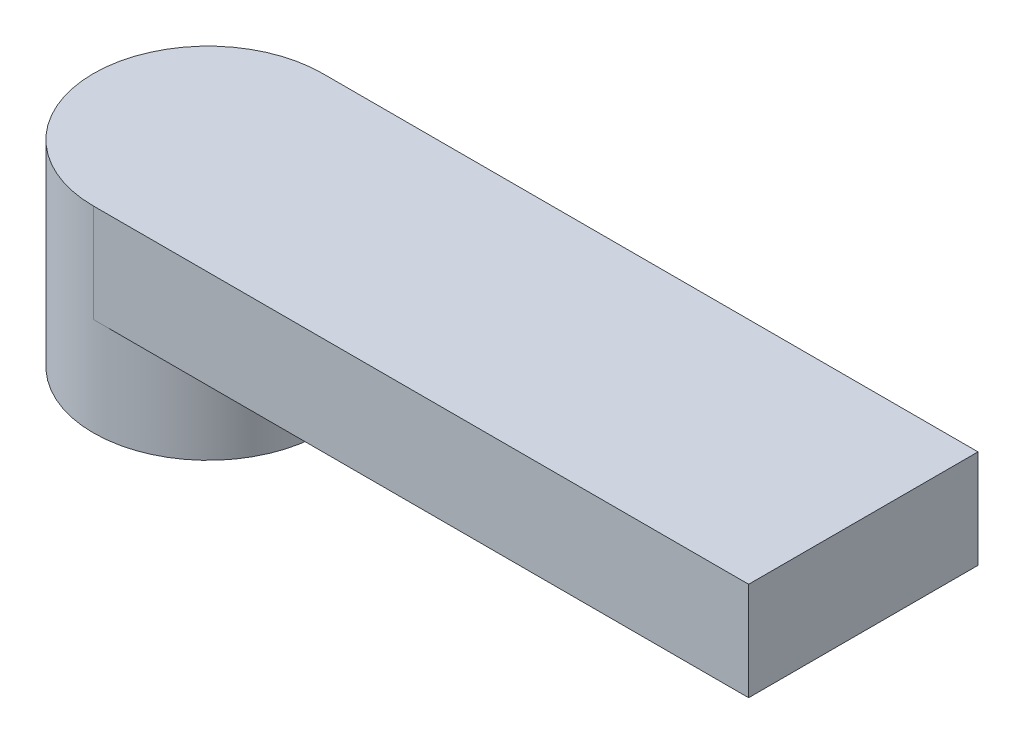
ISO-10303-21;
HEADER;
FILE_DESCRIPTION(('STEP AP214'),'2;1');
FILE_NAME('part.step','',(''),(''),'','','');
FILE_SCHEMA(('AUTOMOTIVE_DESIGN { 1 0 10303 214 1 1 1 1 }'));
ENDSEC;
DATA;
#1=APPLICATION_CONTEXT('core data for automotive mechanical design processes');
#2=APPLICATION_PROTOCOL_DEFINITION('international standard','automotive_design',2000,#1);
#3=PRODUCT_CONTEXT('',#1,'mechanical');
#4=PRODUCT('Part','Part','',(#3));
#5=PRODUCT_RELATED_PRODUCT_CATEGORY('part','',(#4));
#6=PRODUCT_DEFINITION_FORMATION('','',#4);
#7=PRODUCT_DEFINITION_CONTEXT('part definition',#1,'design');
#8=PRODUCT_DEFINITION('design','',#6,#7);
#9=PRODUCT_DEFINITION_SHAPE('','',#8);
#10=(LENGTH_UNIT() NAMED_UNIT(*) SI_UNIT(.MILLI.,.METRE.));
#11=(NAMED_UNIT(*) PLANE_ANGLE_UNIT() SI_UNIT($,.RADIAN.));
#12=(NAMED_UNIT(*) SI_UNIT($,.STERADIAN.) SOLID_ANGLE_UNIT());
#13=UNCERTAINTY_MEASURE_WITH_UNIT(LENGTH_MEASURE(1.E-05),#10,'distance_accuracy_value','');
#14=(GEOMETRIC_REPRESENTATION_CONTEXT(3) GLOBAL_UNCERTAINTY_ASSIGNED_CONTEXT((#13)) GLOBAL_UNIT_ASSIGNED_CONTEXT((#10,
#11,#12)) REPRESENTATION_CONTEXT('',''));
#15=CARTESIAN_POINT('',(0.,0.,0.));
#16=DIRECTION('',(0.,0.,1.));
#17=DIRECTION('',(1.,0.,0.));
#18=AXIS2_PLACEMENT_3D('',#15,#16,#17);
#19=CARTESIAN_POINT('',(0.,6.,0.));
#20=DIRECTION('',(0.,-1.,0.));
#21=DIRECTION('',(0.,0.,-1.));
#22=AXIS2_PLACEMENT_3D('',#19,#20,#21);
#23=CYLINDRICAL_SURFACE('',#22,3.5);
#24=CARTESIAN_POINT('',(0.,6.,0.));
#25=DIRECTION('',(0.,1.,0.));
#26=DIRECTION('',(0.,0.,1.));
#27=AXIS2_PLACEMENT_3D('',#24,#25,#26);
#28=CIRCLE('',#27,3.5);
#29=CARTESIAN_POINT('',(0.,6.,-3.5));
#30=VERTEX_POINT('',#29);
#31=CARTESIAN_POINT('',(0.,6.,3.5));
#32=VERTEX_POINT('',#31);
#33=EDGE_CURVE('E11',#30,#32,#28,.T.);
#34=ORIENTED_EDGE('',*,*,#33,.F.);
#35=DIRECTION('',(0.,1.,0.));
#36=VECTOR('',#35,1.);
#37=CARTESIAN_POINT('',(0.,3.,-3.5));
#38=LINE('',#37,#36);
#39=CARTESIAN_POINT('',(0.,3.,-3.5));
#40=VERTEX_POINT('',#39);
#41=EDGE_CURVE('E116',#40,#30,#38,.T.);
#42=ORIENTED_EDGE('',*,*,#41,.F.);
#43=CARTESIAN_POINT('',(0.,3.,0.));
#44=DIRECTION('',(0.,-1.,0.));
#45=DIRECTION('',(0.,0.,1.));
#46=AXIS2_PLACEMENT_3D('',#43,#44,#45);
#47=CIRCLE('',#46,3.5);
#48=CARTESIAN_POINT('',(0.,3.,3.5));
#49=VERTEX_POINT('',#48);
#50=EDGE_CURVE('E62',#40,#49,#47,.T.);
#51=ORIENTED_EDGE('',*,*,#50,.T.);
#52=DIRECTION('',(0.,1.,0.));
#53=VECTOR('',#52,1.);
#54=CARTESIAN_POINT('',(0.,3.,3.5));
#55=LINE('',#54,#53);
#56=EDGE_CURVE('E86',#49,#32,#55,.T.);
#57=ORIENTED_EDGE('',*,*,#56,.T.);
#58=EDGE_LOOP('',(#34,#42,#51,#57));
#59=FACE_BOUND('',#58,.T.);
#60=CARTESIAN_POINT('',(0.,0.,0.));
#61=DIRECTION('',(0.,1.,0.));
#62=DIRECTION('',(0.,0.,1.));
#63=AXIS2_PLACEMENT_3D('',#60,#61,#62);
#64=CIRCLE('',#63,3.5);
#65=CARTESIAN_POINT('',(0.,0.,3.5));
#66=VERTEX_POINT('',#65);
#67=EDGE_CURVE('E42',#66,#66,#64,.T.);
#68=ORIENTED_EDGE('',*,*,#67,.T.);
#69=EDGE_LOOP('',(#68));
#70=FACE_BOUND('',#69,.T.);
#71=ADVANCED_FACE('F39',(#59,#70),#23,.T.);
#72=CARTESIAN_POINT('',(0.,6.,0.));
#73=DIRECTION('',(0.,1.,0.));
#74=DIRECTION('',(0.,0.,1.));
#75=AXIS2_PLACEMENT_3D('',#72,#73,#74);
#76=PLANE('',#75);
#77=ORIENTED_EDGE('',*,*,#33,.T.);
#78=DIRECTION('',(1.,0.,0.));
#79=VECTOR('',#78,1.);
#80=CARTESIAN_POINT('',(20.,6.,3.5));
#81=LINE('',#80,#79);
#82=CARTESIAN_POINT('',(20.,6.,3.5));
#83=VERTEX_POINT('',#82);
#84=EDGE_CURVE('E109',#32,#83,#81,.T.);
#85=ORIENTED_EDGE('',*,*,#84,.T.);
#86=DIRECTION('',(0.,0.,-1.));
#87=VECTOR('',#86,1.);
#88=CARTESIAN_POINT('',(20.,6.,-3.5));
#89=LINE('',#88,#87);
#90=CARTESIAN_POINT('',(20.,6.,-3.5));
#91=VERTEX_POINT('',#90);
#92=EDGE_CURVE('E92',#83,#91,#89,.T.);
#93=ORIENTED_EDGE('',*,*,#92,.T.);
#94=DIRECTION('',(-1.,0.,0.));
#95=VECTOR('',#94,1.);
#96=CARTESIAN_POINT('',(0.,6.,-3.5));
#97=LINE('',#96,#95);
#98=EDGE_CURVE('E53',#91,#30,#97,.T.);
#99=ORIENTED_EDGE('',*,*,#98,.T.);
#100=EDGE_LOOP('',(#77,#85,#93,#99));
#101=FACE_BOUND('',#100,.T.);
#102=ADVANCED_FACE('F137',(#101),#76,.T.);
#103=CARTESIAN_POINT('',(0.,0.,0.));
#104=DIRECTION('',(0.,1.,0.));
#105=DIRECTION('',(0.,0.,1.));
#106=AXIS2_PLACEMENT_3D('',#103,#104,#105);
#107=PLANE('',#106);
#108=CARTESIAN_POINT('',(0.,0.,0.));
#109=DIRECTION('',(0.,-1.,0.));
#110=DIRECTION('',(0.,0.,-1.));
#111=AXIS2_PLACEMENT_3D('',#108,#109,#110);
#112=CIRCLE('',#111,2.475);
#113=CARTESIAN_POINT('',(0.,0.,-2.475));
#114=VERTEX_POINT('',#113);
#115=EDGE_CURVE('E119',#114,#114,#112,.T.);
#116=ORIENTED_EDGE('',*,*,#115,.F.);
#117=EDGE_LOOP('',(#116));
#118=FACE_BOUND('',#117,.T.);
#119=ORIENTED_EDGE('',*,*,#67,.F.);
#120=EDGE_LOOP('',(#119));
#121=FACE_BOUND('',#120,.T.);
#122=ADVANCED_FACE('F134',(#118,#121),#107,.F.);
#123=CARTESIAN_POINT('',(0.,2.5,0.));
#124=DIRECTION('',(0.,-1.,0.));
#125=DIRECTION('',(0.,0.,-1.));
#126=AXIS2_PLACEMENT_3D('',#123,#124,#125);
#127=CYLINDRICAL_SURFACE('',#126,2.475);
#128=CARTESIAN_POINT('',(0.,2.5,0.));
#129=DIRECTION('',(0.,-1.,0.));
#130=DIRECTION('',(0.,0.,-1.));
#131=AXIS2_PLACEMENT_3D('',#128,#129,#130);
#132=CIRCLE('',#131,2.475);
#133=CARTESIAN_POINT('',(0.,2.5,-2.475));
#134=VERTEX_POINT('',#133);
#135=EDGE_CURVE('E124',#134,#134,#132,.T.);
#136=ORIENTED_EDGE('',*,*,#135,.F.);
#137=EDGE_LOOP('',(#136));
#138=FACE_BOUND('',#137,.T.);
#139=ORIENTED_EDGE('',*,*,#115,.T.);
#140=EDGE_LOOP('',(#139));
#141=FACE_BOUND('',#140,.T.);
#142=ADVANCED_FACE('F132',(#138,#141),#127,.F.);
#143=CARTESIAN_POINT('',(0.,2.5,0.));
#144=DIRECTION('',(0.,-1.,0.));
#145=DIRECTION('',(0.,0.,-1.));
#146=AXIS2_PLACEMENT_3D('',#143,#144,#145);
#147=PLANE('',#146);
#148=ORIENTED_EDGE('',*,*,#135,.T.);
#149=EDGE_LOOP('',(#148));
#150=FACE_BOUND('',#149,.T.);
#151=ADVANCED_FACE('F155',(#150),#147,.T.);
#152=CARTESIAN_POINT('',(0.,3.,-3.5));
#153=DIRECTION('',(0.,0.,-1.));
#154=DIRECTION('',(-1.,0.,0.));
#155=AXIS2_PLACEMENT_3D('',#152,#153,#154);
#156=PLANE('',#155);
#157=ORIENTED_EDGE('',*,*,#98,.F.);
#158=DIRECTION('',(0.,1.,0.));
#159=VECTOR('',#158,1.);
#160=CARTESIAN_POINT('',(20.,3.,-3.5));
#161=LINE('',#160,#159);
#162=CARTESIAN_POINT('',(20.,3.,-3.5));
#163=VERTEX_POINT('',#162);
#164=EDGE_CURVE('E80',#163,#91,#161,.T.);
#165=ORIENTED_EDGE('',*,*,#164,.F.);
#166=DIRECTION('',(-1.,0.,0.));
#167=VECTOR('',#166,1.);
#168=CARTESIAN_POINT('',(0.,3.,-3.5));
#169=LINE('',#168,#167);
#170=EDGE_CURVE('E98',#163,#40,#169,.T.);
#171=ORIENTED_EDGE('',*,*,#170,.T.);
#172=ORIENTED_EDGE('',*,*,#41,.T.);
#173=EDGE_LOOP('',(#157,#165,#171,#172));
#174=FACE_BOUND('',#173,.T.);
#175=ADVANCED_FACE('F153',(#174),#156,.T.);
#176=CARTESIAN_POINT('',(20.,3.,-3.5));
#177=DIRECTION('',(1.,0.,0.));
#178=DIRECTION('',(0.,0.,-1.));
#179=AXIS2_PLACEMENT_3D('',#176,#177,#178);
#180=PLANE('',#179);
#181=ORIENTED_EDGE('',*,*,#92,.F.);
#182=DIRECTION('',(0.,1.,0.));
#183=VECTOR('',#182,1.);
#184=CARTESIAN_POINT('',(20.,3.,3.5));
#185=LINE('',#184,#183);
#186=CARTESIAN_POINT('',(20.,3.,3.5));
#187=VERTEX_POINT('',#186);
#188=EDGE_CURVE('E88',#187,#83,#185,.T.);
#189=ORIENTED_EDGE('',*,*,#188,.F.);
#190=DIRECTION('',(0.,0.,-1.));
#191=VECTOR('',#190,1.);
#192=CARTESIAN_POINT('',(20.,3.,-3.5));
#193=LINE('',#192,#191);
#194=EDGE_CURVE('E91',#187,#163,#193,.T.);
#195=ORIENTED_EDGE('',*,*,#194,.T.);
#196=ORIENTED_EDGE('',*,*,#164,.T.);
#197=EDGE_LOOP('',(#181,#189,#195,#196));
#198=FACE_BOUND('',#197,.T.);
#199=ADVANCED_FACE('F90',(#198),#180,.T.);
#200=CARTESIAN_POINT('',(20.,3.,3.5));
#201=DIRECTION('',(0.,0.,1.));
#202=DIRECTION('',(1.,0.,0.));
#203=AXIS2_PLACEMENT_3D('',#200,#201,#202);
#204=PLANE('',#203);
#205=ORIENTED_EDGE('',*,*,#84,.F.);
#206=ORIENTED_EDGE('',*,*,#56,.F.);
#207=DIRECTION('',(1.,0.,0.));
#208=VECTOR('',#207,1.);
#209=CARTESIAN_POINT('',(20.,3.,3.5));
#210=LINE('',#209,#208);
#211=EDGE_CURVE('E97',#49,#187,#210,.T.);
#212=ORIENTED_EDGE('',*,*,#211,.T.);
#213=ORIENTED_EDGE('',*,*,#188,.T.);
#214=EDGE_LOOP('',(#205,#206,#212,#213));
#215=FACE_BOUND('',#214,.T.);
#216=ADVANCED_FACE('F101',(#215),#204,.T.);
#217=CARTESIAN_POINT('',(0.,3.,0.));
#218=DIRECTION('',(0.,1.,0.));
#219=DIRECTION('',(0.,0.,1.));
#220=AXIS2_PLACEMENT_3D('',#217,#218,#219);
#221=PLANE('',#220);
#222=ORIENTED_EDGE('',*,*,#50,.F.);
#223=ORIENTED_EDGE('',*,*,#170,.F.);
#224=ORIENTED_EDGE('',*,*,#194,.F.);
#225=ORIENTED_EDGE('',*,*,#211,.F.);
#226=EDGE_LOOP('',(#222,#223,#224,#225));
#227=FACE_BOUND('',#226,.T.);
#228=ADVANCED_FACE('F96',(#227),#221,.F.);
#229=CLOSED_SHELL('',(#71,#102,#122,#142,#151,#175,#199,#216,#228));
#230=MANIFOLD_SOLID_BREP('B2',#229);
#231=ADVANCED_BREP_SHAPE_REPRESENTATION('',(#18,#230),#14);
#232=SHAPE_DEFINITION_REPRESENTATION(#9,#231);
ENDSEC;
END-ISO-10303-21;
